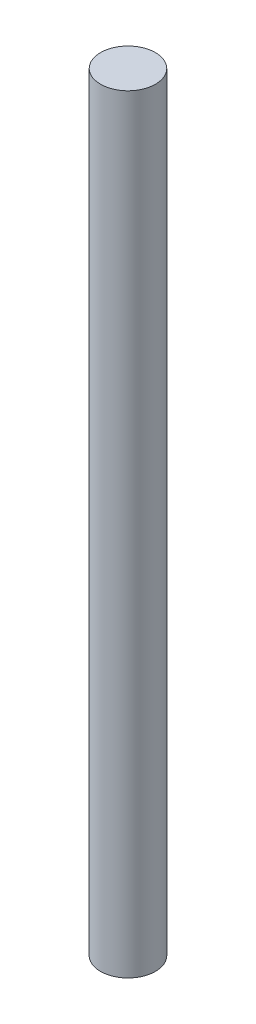
ISO-10303-21;
HEADER;
FILE_DESCRIPTION(('STEP AP214'),'2;1');
FILE_NAME('part.step','',(''),(''),'','','');
FILE_SCHEMA(('AUTOMOTIVE_DESIGN { 1 0 10303 214 1 1 1 1 }'));
ENDSEC;
DATA;
#1=APPLICATION_CONTEXT('core data for automotive mechanical design processes');
#2=APPLICATION_PROTOCOL_DEFINITION('international standard','automotive_design',2000,#1);
#3=PRODUCT_CONTEXT('',#1,'mechanical');
#4=PRODUCT('Part','Part','',(#3));
#5=PRODUCT_RELATED_PRODUCT_CATEGORY('part','',(#4));
#6=PRODUCT_DEFINITION_FORMATION('','',#4);
#7=PRODUCT_DEFINITION_CONTEXT('part definition',#1,'design');
#8=PRODUCT_DEFINITION('design','',#6,#7);
#9=PRODUCT_DEFINITION_SHAPE('','',#8);
#10=(LENGTH_UNIT() NAMED_UNIT(*) SI_UNIT(.MILLI.,.METRE.));
#11=(NAMED_UNIT(*) PLANE_ANGLE_UNIT() SI_UNIT($,.RADIAN.));
#12=(NAMED_UNIT(*) SI_UNIT($,.STERADIAN.) SOLID_ANGLE_UNIT());
#13=UNCERTAINTY_MEASURE_WITH_UNIT(LENGTH_MEASURE(1.E-05),#10,'distance_accuracy_value','');
#14=(GEOMETRIC_REPRESENTATION_CONTEXT(3) GLOBAL_UNCERTAINTY_ASSIGNED_CONTEXT((#13)) GLOBAL_UNIT_ASSIGNED_CONTEXT((#10,
#11,#12)) REPRESENTATION_CONTEXT('',''));
#15=CARTESIAN_POINT('',(0.,0.,0.));
#16=DIRECTION('',(0.,0.,1.));
#17=DIRECTION('',(1.,0.,0.));
#18=AXIS2_PLACEMENT_3D('',#15,#16,#17);
#19=CARTESIAN_POINT('',(0.,88.9,0.));
#20=DIRECTION('',(0.,-1.,0.));
#21=DIRECTION('',(0.,0.,-1.));
#22=AXIS2_PLACEMENT_3D('',#19,#20,#21);
#23=CYLINDRICAL_SURFACE('',#22,3.175);
#24=CARTESIAN_POINT('',(0.,88.9,0.));
#25=DIRECTION('',(0.,1.,0.));
#26=DIRECTION('',(0.,0.,1.));
#27=AXIS2_PLACEMENT_3D('',#24,#25,#26);
#28=CIRCLE('',#27,3.175);
#29=CARTESIAN_POINT('',(0.,88.9,3.175));
#30=VERTEX_POINT('',#29);
#31=EDGE_CURVE('E10',#30,#30,#28,.T.);
#32=ORIENTED_EDGE('',*,*,#31,.F.);
#33=EDGE_LOOP('',(#32));
#34=FACE_BOUND('',#33,.T.);
#35=CARTESIAN_POINT('',(0.,0.,0.));
#36=DIRECTION('',(0.,1.,0.));
#37=DIRECTION('',(0.,0.,1.));
#38=AXIS2_PLACEMENT_3D('',#35,#36,#37);
#39=CIRCLE('',#38,3.175);
#40=CARTESIAN_POINT('',(0.,0.,3.175));
#41=VERTEX_POINT('',#40);
#42=EDGE_CURVE('E37',#41,#41,#39,.T.);
#43=ORIENTED_EDGE('',*,*,#42,.T.);
#44=EDGE_LOOP('',(#43));
#45=FACE_BOUND('',#44,.T.);
#46=ADVANCED_FACE('F34',(#34,#45),#23,.T.);
#47=CARTESIAN_POINT('',(0.,88.9,0.));
#48=DIRECTION('',(0.,1.,0.));
#49=DIRECTION('',(0.,0.,1.));
#50=AXIS2_PLACEMENT_3D('',#47,#48,#49);
#51=PLANE('',#50);
#52=ORIENTED_EDGE('',*,*,#31,.T.);
#53=EDGE_LOOP('',(#52));
#54=FACE_BOUND('',#53,.T.);
#55=ADVANCED_FACE('F49',(#54),#51,.T.);
#56=CARTESIAN_POINT('',(0.,0.,0.));
#57=DIRECTION('',(0.,1.,0.));
#58=DIRECTION('',(0.,0.,1.));
#59=AXIS2_PLACEMENT_3D('',#56,#57,#58);
#60=PLANE('',#59);
#61=ORIENTED_EDGE('',*,*,#42,.F.);
#62=EDGE_LOOP('',(#61));
#63=FACE_BOUND('',#62,.T.);
#64=ADVANCED_FACE('F47',(#63),#60,.F.);
#65=CLOSED_SHELL('',(#46,#55,#64));
#66=MANIFOLD_SOLID_BREP('B2',#65);
#67=ADVANCED_BREP_SHAPE_REPRESENTATION('',(#18,#66),#14);
#68=SHAPE_DEFINITION_REPRESENTATION(#9,#67);
ENDSEC;
END-ISO-10303-21;
